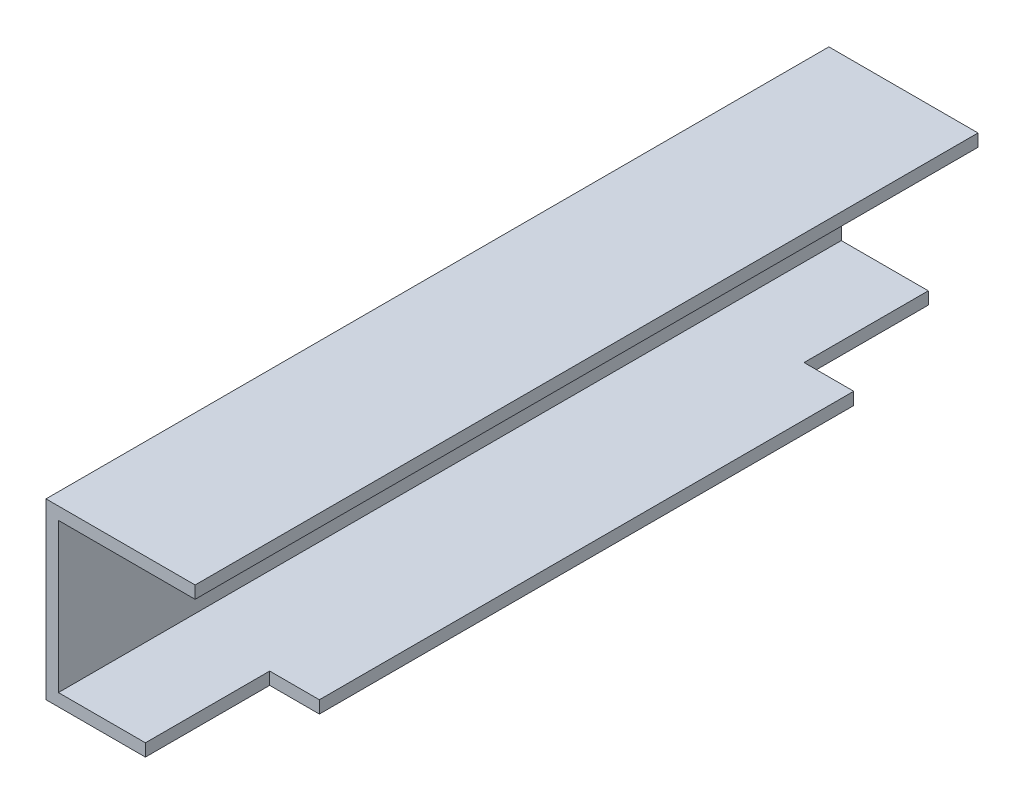
ISO-10303-21;
HEADER;
FILE_DESCRIPTION(('STEP AP214'),'2;1');
FILE_NAME('part.step','',(''),(''),'','','');
FILE_SCHEMA(('AUTOMOTIVE_DESIGN { 1 0 10303 214 1 1 1 1 }'));
ENDSEC;
DATA;
#1=APPLICATION_CONTEXT('core data for automotive mechanical design processes');
#2=APPLICATION_PROTOCOL_DEFINITION('international standard','automotive_design',2000,#1);
#3=PRODUCT_CONTEXT('',#1,'mechanical');
#4=PRODUCT('Part','Part','',(#3));
#5=PRODUCT_RELATED_PRODUCT_CATEGORY('part','',(#4));
#6=PRODUCT_DEFINITION_FORMATION('','',#4);
#7=PRODUCT_DEFINITION_CONTEXT('part definition',#1,'design');
#8=PRODUCT_DEFINITION('design','',#6,#7);
#9=PRODUCT_DEFINITION_SHAPE('','',#8);
#10=(LENGTH_UNIT() NAMED_UNIT(*) SI_UNIT(.MILLI.,.METRE.));
#11=(NAMED_UNIT(*) PLANE_ANGLE_UNIT() SI_UNIT($,.RADIAN.));
#12=(NAMED_UNIT(*) SI_UNIT($,.STERADIAN.) SOLID_ANGLE_UNIT());
#13=UNCERTAINTY_MEASURE_WITH_UNIT(LENGTH_MEASURE(1.E-05),#10,'distance_accuracy_value','');
#14=(GEOMETRIC_REPRESENTATION_CONTEXT(3) GLOBAL_UNCERTAINTY_ASSIGNED_CONTEXT((#13)) GLOBAL_UNIT_ASSIGNED_CONTEXT((#10,
#11,#12)) REPRESENTATION_CONTEXT('',''));
#15=CARTESIAN_POINT('',(0.,0.,0.));
#16=DIRECTION('',(0.,0.,1.));
#17=DIRECTION('',(1.,0.,0.));
#18=AXIS2_PLACEMENT_3D('',#15,#16,#17);
#19=CARTESIAN_POINT('',(0.413333327827212,0.,2.65));
#20=DIRECTION('',(0.,0.,-1.));
#21=DIRECTION('',(-1.,0.,0.));
#22=AXIS2_PLACEMENT_3D('',#19,#20,#21);
#23=PLANE('',#22);
#24=DIRECTION('',(1.,0.,0.));
#25=VECTOR('',#24,1.);
#26=CARTESIAN_POINT('',(0.213333327827213,0.0500000000000002,2.65));
#27=LINE('',#26,#25);
#28=CARTESIAN_POINT('',(0.213333327827213,0.0500000000000002,2.65));
#29=VERTEX_POINT('',#28);
#30=CARTESIAN_POINT('',(0.413333327827212,0.0500000000000003,2.65));
#31=VERTEX_POINT('',#30);
#32=EDGE_CURVE('E11',#29,#31,#27,.T.);
#33=ORIENTED_EDGE('',*,*,#32,.F.);
#34=DIRECTION('',(0.,1.,0.));
#35=VECTOR('',#34,1.);
#36=CARTESIAN_POINT('',(0.213333327827213,0.,2.65));
#37=LINE('',#36,#35);
#38=CARTESIAN_POINT('',(0.213333327827213,0.,2.65));
#39=VERTEX_POINT('',#38);
#40=EDGE_CURVE('E203',#39,#29,#37,.T.);
#41=ORIENTED_EDGE('',*,*,#40,.F.);
#42=DIRECTION('',(-1.,0.,0.));
#43=VECTOR('',#42,1.);
#44=CARTESIAN_POINT('',(0.413333327827212,0.,2.65));
#45=LINE('',#44,#43);
#46=CARTESIAN_POINT('',(0.413333327827212,0.,2.65));
#47=VERTEX_POINT('',#46);
#48=EDGE_CURVE('E195',#47,#39,#45,.T.);
#49=ORIENTED_EDGE('',*,*,#48,.F.);
#50=DIRECTION('',(0.,-1.,0.));
#51=VECTOR('',#50,1.);
#52=CARTESIAN_POINT('',(0.413333327827213,0.0500000000000003,2.65));
#53=LINE('',#52,#51);
#54=EDGE_CURVE('E183',#31,#47,#53,.T.);
#55=ORIENTED_EDGE('',*,*,#54,.F.);
#56=EDGE_LOOP('',(#33,#41,#49,#55));
#57=FACE_BOUND('',#56,.T.);
#58=ADVANCED_FACE('F17',(#57),#23,.F.);
#59=CARTESIAN_POINT('',(0.213333327827213,0.,2.65));
#60=DIRECTION('',(-1.,0.,0.));
#61=DIRECTION('',(0.,0.,1.));
#62=AXIS2_PLACEMENT_3D('',#59,#60,#61);
#63=PLANE('',#62);
#64=DIRECTION('',(0.,0.,-1.));
#65=VECTOR('',#64,1.);
#66=CARTESIAN_POINT('',(0.213333327827213,0.0500000000000002,3.15));
#67=LINE('',#66,#65);
#68=CARTESIAN_POINT('',(0.213333327827212,0.0500000000000002,3.15));
#69=VERTEX_POINT('',#68);
#70=EDGE_CURVE('E24',#69,#29,#67,.T.);
#71=ORIENTED_EDGE('',*,*,#70,.F.);
#72=DIRECTION('',(0.,1.,0.));
#73=VECTOR('',#72,1.);
#74=CARTESIAN_POINT('',(0.213333327827212,0.,3.15));
#75=LINE('',#74,#73);
#76=CARTESIAN_POINT('',(0.213333327827212,0.,3.15));
#77=VERTEX_POINT('',#76);
#78=EDGE_CURVE('E198',#77,#69,#75,.T.);
#79=ORIENTED_EDGE('',*,*,#78,.F.);
#80=DIRECTION('',(0.,0.,1.));
#81=VECTOR('',#80,1.);
#82=CARTESIAN_POINT('',(0.213333327827213,0.,2.65));
#83=LINE('',#82,#81);
#84=EDGE_CURVE('E186',#39,#77,#83,.T.);
#85=ORIENTED_EDGE('',*,*,#84,.F.);
#86=ORIENTED_EDGE('',*,*,#40,.T.);
#87=EDGE_LOOP('',(#71,#79,#85,#86));
#88=FACE_BOUND('',#87,.T.);
#89=ADVANCED_FACE('F209',(#88),#63,.F.);
#90=CARTESIAN_POINT('',(0.213333327827213,0.,0.5));
#91=DIRECTION('',(0.,0.,1.));
#92=DIRECTION('',(1.,0.,0.));
#93=AXIS2_PLACEMENT_3D('',#90,#91,#92);
#94=PLANE('',#93);
#95=DIRECTION('',(-1.,0.,0.));
#96=VECTOR('',#95,1.);
#97=CARTESIAN_POINT('',(0.413333327827213,0.0500000000000003,0.5));
#98=LINE('',#97,#96);
#99=CARTESIAN_POINT('',(0.413333327827213,0.0500000000000003,0.5));
#100=VERTEX_POINT('',#99);
#101=CARTESIAN_POINT('',(0.213333327827213,0.0500000000000002,0.5));
#102=VERTEX_POINT('',#101);
#103=EDGE_CURVE('E200',#100,#102,#98,.T.);
#104=ORIENTED_EDGE('',*,*,#103,.F.);
#105=DIRECTION('',(0.,1.,0.));
#106=VECTOR('',#105,1.);
#107=CARTESIAN_POINT('',(0.413333327827213,0.,0.5));
#108=LINE('',#107,#106);
#109=CARTESIAN_POINT('',(0.413333327827213,0.,0.5));
#110=VERTEX_POINT('',#109);
#111=EDGE_CURVE('E189',#110,#100,#108,.T.);
#112=ORIENTED_EDGE('',*,*,#111,.F.);
#113=DIRECTION('',(1.,0.,0.));
#114=VECTOR('',#113,1.);
#115=CARTESIAN_POINT('',(0.213333327827213,0.,0.5));
#116=LINE('',#115,#114);
#117=CARTESIAN_POINT('',(0.213333327827213,0.,0.5));
#118=VERTEX_POINT('',#117);
#119=EDGE_CURVE('E177',#118,#110,#116,.T.);
#120=ORIENTED_EDGE('',*,*,#119,.F.);
#121=DIRECTION('',(0.,1.,0.));
#122=VECTOR('',#121,1.);
#123=CARTESIAN_POINT('',(0.213333327827213,0.,0.5));
#124=LINE('',#123,#122);
#125=EDGE_CURVE('E180',#118,#102,#124,.T.);
#126=ORIENTED_EDGE('',*,*,#125,.T.);
#127=EDGE_LOOP('',(#104,#112,#120,#126));
#128=FACE_BOUND('',#127,.T.);
#129=ADVANCED_FACE('F217',(#128),#94,.F.);
#130=CARTESIAN_POINT('',(0.213333327827213,0.,0.));
#131=DIRECTION('',(-1.,0.,0.));
#132=DIRECTION('',(0.,0.,1.));
#133=AXIS2_PLACEMENT_3D('',#130,#131,#132);
#134=PLANE('',#133);
#135=DIRECTION('',(0.,0.,-1.));
#136=VECTOR('',#135,1.);
#137=CARTESIAN_POINT('',(0.213333327827213,0.0500000000000002,0.5));
#138=LINE('',#137,#136);
#139=CARTESIAN_POINT('',(0.213333327827213,0.0500000000000002,0.));
#140=VERTEX_POINT('',#139);
#141=EDGE_CURVE('E192',#102,#140,#138,.T.);
#142=ORIENTED_EDGE('',*,*,#141,.F.);
#143=ORIENTED_EDGE('',*,*,#125,.F.);
#144=DIRECTION('',(0.,0.,1.));
#145=VECTOR('',#144,1.);
#146=CARTESIAN_POINT('',(0.213333327827213,0.,0.));
#147=LINE('',#146,#145);
#148=CARTESIAN_POINT('',(0.213333327827213,0.,0.));
#149=VERTEX_POINT('',#148);
#150=EDGE_CURVE('E174',#149,#118,#147,.T.);
#151=ORIENTED_EDGE('',*,*,#150,.F.);
#152=DIRECTION('',(0.,-1.,0.));
#153=VECTOR('',#152,1.);
#154=CARTESIAN_POINT('',(0.213333327827213,0.0500000000000002,0.));
#155=LINE('',#154,#153);
#156=EDGE_CURVE('E164',#140,#149,#155,.T.);
#157=ORIENTED_EDGE('',*,*,#156,.F.);
#158=EDGE_LOOP('',(#142,#143,#151,#157));
#159=FACE_BOUND('',#158,.T.);
#160=ADVANCED_FACE('F220',(#159),#134,.F.);
#161=CARTESIAN_POINT('',(-0.186666672172787,0.,0.));
#162=DIRECTION('',(0.,-1.,0.));
#163=DIRECTION('',(1.,0.,0.));
#164=AXIS2_PLACEMENT_3D('',#161,#162,#163);
#165=PLANE('',#164);
#166=ORIENTED_EDGE('',*,*,#48,.T.);
#167=ORIENTED_EDGE('',*,*,#84,.T.);
#168=DIRECTION('',(1.,0.,0.));
#169=VECTOR('',#168,1.);
#170=CARTESIAN_POINT('',(-0.186666672172787,0.,3.15));
#171=LINE('',#170,#169);
#172=CARTESIAN_POINT('',(-0.186666672172787,0.,3.15));
#173=VERTEX_POINT('',#172);
#174=EDGE_CURVE('E167',#173,#77,#171,.T.);
#175=ORIENTED_EDGE('',*,*,#174,.F.);
#176=DIRECTION('',(0.,0.,1.));
#177=VECTOR('',#176,1.);
#178=CARTESIAN_POINT('',(-0.186666672172787,0.,0.));
#179=LINE('',#178,#177);
#180=CARTESIAN_POINT('',(-0.186666672172787,0.,0.));
#181=VERTEX_POINT('',#180);
#182=EDGE_CURVE('E120',#181,#173,#179,.T.);
#183=ORIENTED_EDGE('',*,*,#182,.F.);
#184=DIRECTION('',(1.,0.,0.));
#185=VECTOR('',#184,1.);
#186=CARTESIAN_POINT('',(-0.186666672172787,0.,0.));
#187=LINE('',#186,#185);
#188=EDGE_CURVE('E148',#181,#149,#187,.T.);
#189=ORIENTED_EDGE('',*,*,#188,.T.);
#190=ORIENTED_EDGE('',*,*,#150,.T.);
#191=ORIENTED_EDGE('',*,*,#119,.T.);
#192=DIRECTION('',(0.,0.,1.));
#193=VECTOR('',#192,1.);
#194=CARTESIAN_POINT('',(0.413333327827213,0.,0.5));
#195=LINE('',#194,#193);
#196=EDGE_CURVE('E169',#110,#47,#195,.T.);
#197=ORIENTED_EDGE('',*,*,#196,.T.);
#198=EDGE_LOOP('',(#166,#167,#175,#183,#189,#190,#191,#197));
#199=FACE_BOUND('',#198,.T.);
#200=ADVANCED_FACE('F211',(#199),#165,.T.);
#201=CARTESIAN_POINT('',(0.413333327827213,0.,0.));
#202=DIRECTION('',(1.,0.,0.));
#203=DIRECTION('',(0.,1.,0.));
#204=AXIS2_PLACEMENT_3D('',#201,#202,#203);
#205=PLANE('',#204);
#206=ORIENTED_EDGE('',*,*,#54,.T.);
#207=ORIENTED_EDGE('',*,*,#196,.F.);
#208=ORIENTED_EDGE('',*,*,#111,.T.);
#209=DIRECTION('',(0.,0.,1.));
#210=VECTOR('',#209,1.);
#211=CARTESIAN_POINT('',(0.413333327827213,0.0500000000000003,0.5));
#212=LINE('',#211,#210);
#213=EDGE_CURVE('E151',#100,#31,#212,.T.);
#214=ORIENTED_EDGE('',*,*,#213,.T.);
#215=EDGE_LOOP('',(#206,#207,#208,#214));
#216=FACE_BOUND('',#215,.T.);
#217=ADVANCED_FACE('F214',(#216),#205,.T.);
#218=CARTESIAN_POINT('',(0.413333327827213,0.65,0.));
#219=DIRECTION('',(1.,0.,0.));
#220=DIRECTION('',(0.,1.,0.));
#221=AXIS2_PLACEMENT_3D('',#218,#219,#220);
#222=PLANE('',#221);
#223=DIRECTION('',(0.,1.,0.));
#224=VECTOR('',#223,1.);
#225=CARTESIAN_POINT('',(0.413333327827213,0.65,0.));
#226=LINE('',#225,#224);
#227=CARTESIAN_POINT('',(0.413333327827213,0.65,0.));
#228=VERTEX_POINT('',#227);
#229=CARTESIAN_POINT('',(0.413333327827213,0.7,0.));
#230=VERTEX_POINT('',#229);
#231=EDGE_CURVE('E172',#228,#230,#226,.T.);
#232=ORIENTED_EDGE('',*,*,#231,.T.);
#233=DIRECTION('',(0.,0.,1.));
#234=VECTOR('',#233,1.);
#235=CARTESIAN_POINT('',(0.413333327827213,0.7,0.));
#236=LINE('',#235,#234);
#237=CARTESIAN_POINT('',(0.413333327827213,0.7,3.15));
#238=VERTEX_POINT('',#237);
#239=EDGE_CURVE('E160',#230,#238,#236,.T.);
#240=ORIENTED_EDGE('',*,*,#239,.T.);
#241=DIRECTION('',(0.,1.,0.));
#242=VECTOR('',#241,1.);
#243=CARTESIAN_POINT('',(0.413333327827213,0.65,3.15));
#244=LINE('',#243,#242);
#245=CARTESIAN_POINT('',(0.413333327827213,0.65,3.15));
#246=VERTEX_POINT('',#245);
#247=EDGE_CURVE('E128',#246,#238,#244,.T.);
#248=ORIENTED_EDGE('',*,*,#247,.F.);
#249=DIRECTION('',(0.,0.,1.));
#250=VECTOR('',#249,1.);
#251=CARTESIAN_POINT('',(0.413333327827213,0.65,0.));
#252=LINE('',#251,#250);
#253=EDGE_CURVE('E155',#228,#246,#252,.T.);
#254=ORIENTED_EDGE('',*,*,#253,.F.);
#255=EDGE_LOOP('',(#232,#240,#248,#254));
#256=FACE_BOUND('',#255,.T.);
#257=ADVANCED_FACE('F235',(#256),#222,.T.);
#258=CARTESIAN_POINT('',(-0.136666672172787,0.65,0.));
#259=DIRECTION('',(0.,-1.,0.));
#260=DIRECTION('',(1.,0.,0.));
#261=AXIS2_PLACEMENT_3D('',#258,#259,#260);
#262=PLANE('',#261);
#263=DIRECTION('',(1.,0.,0.));
#264=VECTOR('',#263,1.);
#265=CARTESIAN_POINT('',(-0.136666672172787,0.65,0.));
#266=LINE('',#265,#264);
#267=CARTESIAN_POINT('',(-0.136666672172787,0.65,0.));
#268=VERTEX_POINT('',#267);
#269=EDGE_CURVE('E162',#268,#228,#266,.T.);
#270=ORIENTED_EDGE('',*,*,#269,.T.);
#271=ORIENTED_EDGE('',*,*,#253,.T.);
#272=DIRECTION('',(1.,0.,0.));
#273=VECTOR('',#272,1.);
#274=CARTESIAN_POINT('',(-0.136666672172787,0.65,3.15));
#275=LINE('',#274,#273);
#276=CARTESIAN_POINT('',(-0.136666672172787,0.65,3.15));
#277=VERTEX_POINT('',#276);
#278=EDGE_CURVE('E144',#277,#246,#275,.T.);
#279=ORIENTED_EDGE('',*,*,#278,.F.);
#280=DIRECTION('',(0.,0.,1.));
#281=VECTOR('',#280,1.);
#282=CARTESIAN_POINT('',(-0.136666672172787,0.65,0.));
#283=LINE('',#282,#281);
#284=EDGE_CURVE('E146',#268,#277,#283,.T.);
#285=ORIENTED_EDGE('',*,*,#284,.F.);
#286=EDGE_LOOP('',(#270,#271,#279,#285));
#287=FACE_BOUND('',#286,.T.);
#288=ADVANCED_FACE('F232',(#287),#262,.T.);
#289=CARTESIAN_POINT('',(-0.136666672172787,0.05,0.));
#290=DIRECTION('',(1.,0.,0.));
#291=DIRECTION('',(0.,1.,0.));
#292=AXIS2_PLACEMENT_3D('',#289,#290,#291);
#293=PLANE('',#292);
#294=DIRECTION('',(0.,1.,0.));
#295=VECTOR('',#294,1.);
#296=CARTESIAN_POINT('',(-0.136666672172787,0.05,0.));
#297=LINE('',#296,#295);
#298=CARTESIAN_POINT('',(-0.136666672172787,0.05,0.));
#299=VERTEX_POINT('',#298);
#300=EDGE_CURVE('E157',#299,#268,#297,.T.);
#301=ORIENTED_EDGE('',*,*,#300,.T.);
#302=ORIENTED_EDGE('',*,*,#284,.T.);
#303=DIRECTION('',(0.,1.,0.));
#304=VECTOR('',#303,1.);
#305=CARTESIAN_POINT('',(-0.136666672172787,0.0499999999999999,3.15));
#306=LINE('',#305,#304);
#307=CARTESIAN_POINT('',(-0.136666672172787,0.0499999999999999,3.15));
#308=VERTEX_POINT('',#307);
#309=EDGE_CURVE('E139',#308,#277,#306,.T.);
#310=ORIENTED_EDGE('',*,*,#309,.F.);
#311=DIRECTION('',(0.,0.,1.));
#312=VECTOR('',#311,1.);
#313=CARTESIAN_POINT('',(-0.136666672172787,0.05,0.));
#314=LINE('',#313,#312);
#315=EDGE_CURVE('E114',#299,#308,#314,.T.);
#316=ORIENTED_EDGE('',*,*,#315,.F.);
#317=EDGE_LOOP('',(#301,#302,#310,#316));
#318=FACE_BOUND('',#317,.T.);
#319=ADVANCED_FACE('F229',(#318),#293,.T.);
#320=CARTESIAN_POINT('',(0.413333327827213,0.0500000000000003,0.));
#321=DIRECTION('',(0.,1.,0.));
#322=DIRECTION('',(-1.,0.,0.));
#323=AXIS2_PLACEMENT_3D('',#320,#321,#322);
#324=PLANE('',#323);
#325=ORIENTED_EDGE('',*,*,#32,.T.);
#326=ORIENTED_EDGE('',*,*,#213,.F.);
#327=ORIENTED_EDGE('',*,*,#103,.T.);
#328=ORIENTED_EDGE('',*,*,#141,.T.);
#329=DIRECTION('',(-1.,0.,0.));
#330=VECTOR('',#329,1.);
#331=CARTESIAN_POINT('',(0.213333327827213,0.0500000000000002,0.));
#332=LINE('',#331,#330);
#333=EDGE_CURVE('E129',#140,#299,#332,.T.);
#334=ORIENTED_EDGE('',*,*,#333,.T.);
#335=ORIENTED_EDGE('',*,*,#315,.T.);
#336=DIRECTION('',(-1.,0.,0.));
#337=VECTOR('',#336,1.);
#338=CARTESIAN_POINT('',(0.213333327827212,0.0500000000000002,3.15));
#339=LINE('',#338,#337);
#340=EDGE_CURVE('E123',#69,#308,#339,.T.);
#341=ORIENTED_EDGE('',*,*,#340,.F.);
#342=ORIENTED_EDGE('',*,*,#70,.T.);
#343=EDGE_LOOP('',(#325,#326,#327,#328,#334,#335,#341,#342));
#344=FACE_BOUND('',#343,.T.);
#345=ADVANCED_FACE('F206',(#344),#324,.T.);
#346=CARTESIAN_POINT('',(-0.186666672172787,0.7,0.));
#347=DIRECTION('',(-1.,0.,0.));
#348=DIRECTION('',(0.,-1.,0.));
#349=AXIS2_PLACEMENT_3D('',#346,#347,#348);
#350=PLANE('',#349);
#351=DIRECTION('',(0.,-1.,0.));
#352=VECTOR('',#351,1.);
#353=CARTESIAN_POINT('',(-0.186666672172787,0.7,0.));
#354=LINE('',#353,#352);
#355=CARTESIAN_POINT('',(-0.186666672172787,0.7,0.));
#356=VERTEX_POINT('',#355);
#357=EDGE_CURVE('E142',#356,#181,#354,.T.);
#358=ORIENTED_EDGE('',*,*,#357,.T.);
#359=ORIENTED_EDGE('',*,*,#182,.T.);
#360=DIRECTION('',(0.,-1.,0.));
#361=VECTOR('',#360,1.);
#362=CARTESIAN_POINT('',(-0.186666672172787,0.7,3.15));
#363=LINE('',#362,#361);
#364=CARTESIAN_POINT('',(-0.186666672172787,0.7,3.15));
#365=VERTEX_POINT('',#364);
#366=EDGE_CURVE('E115',#365,#173,#363,.T.);
#367=ORIENTED_EDGE('',*,*,#366,.F.);
#368=DIRECTION('',(0.,0.,1.));
#369=VECTOR('',#368,1.);
#370=CARTESIAN_POINT('',(-0.186666672172787,0.7,0.));
#371=LINE('',#370,#369);
#372=EDGE_CURVE('E102',#356,#365,#371,.T.);
#373=ORIENTED_EDGE('',*,*,#372,.F.);
#374=EDGE_LOOP('',(#358,#359,#367,#373));
#375=FACE_BOUND('',#374,.T.);
#376=ADVANCED_FACE('F119',(#375),#350,.T.);
#377=CARTESIAN_POINT('',(0.413333327827213,0.7,0.));
#378=DIRECTION('',(0.,1.,0.));
#379=DIRECTION('',(-1.,0.,0.));
#380=AXIS2_PLACEMENT_3D('',#377,#378,#379);
#381=PLANE('',#380);
#382=DIRECTION('',(-1.,0.,0.));
#383=VECTOR('',#382,1.);
#384=CARTESIAN_POINT('',(0.413333327827213,0.7,0.));
#385=LINE('',#384,#383);
#386=EDGE_CURVE('E110',#230,#356,#385,.T.);
#387=ORIENTED_EDGE('',*,*,#386,.T.);
#388=ORIENTED_EDGE('',*,*,#372,.T.);
#389=DIRECTION('',(-1.,0.,0.));
#390=VECTOR('',#389,1.);
#391=CARTESIAN_POINT('',(0.413333327827213,0.7,3.15));
#392=LINE('',#391,#390);
#393=EDGE_CURVE('E107',#238,#365,#392,.T.);
#394=ORIENTED_EDGE('',*,*,#393,.F.);
#395=ORIENTED_EDGE('',*,*,#239,.F.);
#396=EDGE_LOOP('',(#387,#388,#394,#395));
#397=FACE_BOUND('',#396,.T.);
#398=ADVANCED_FACE('F104',(#397),#381,.T.);
#399=CARTESIAN_POINT('',(0.0315765710704564,0.35,3.15));
#400=DIRECTION('',(0.,0.,1.));
#401=DIRECTION('',(1.,0.,0.));
#402=AXIS2_PLACEMENT_3D('',#399,#400,#401);
#403=PLANE('',#402);
#404=ORIENTED_EDGE('',*,*,#78,.T.);
#405=ORIENTED_EDGE('',*,*,#340,.T.);
#406=ORIENTED_EDGE('',*,*,#309,.T.);
#407=ORIENTED_EDGE('',*,*,#278,.T.);
#408=ORIENTED_EDGE('',*,*,#247,.T.);
#409=ORIENTED_EDGE('',*,*,#393,.T.);
#410=ORIENTED_EDGE('',*,*,#366,.T.);
#411=ORIENTED_EDGE('',*,*,#174,.T.);
#412=EDGE_LOOP('',(#404,#405,#406,#407,#408,#409,#410,#411));
#413=FACE_BOUND('',#412,.T.);
#414=ADVANCED_FACE('F125',(#413),#403,.T.);
#415=CARTESIAN_POINT('',(0.0315765710704565,0.35,0.));
#416=DIRECTION('',(0.,0.,1.));
#417=DIRECTION('',(1.,0.,0.));
#418=AXIS2_PLACEMENT_3D('',#415,#416,#417);
#419=PLANE('',#418);
#420=ORIENTED_EDGE('',*,*,#156,.T.);
#421=ORIENTED_EDGE('',*,*,#188,.F.);
#422=ORIENTED_EDGE('',*,*,#357,.F.);
#423=ORIENTED_EDGE('',*,*,#386,.F.);
#424=ORIENTED_EDGE('',*,*,#231,.F.);
#425=ORIENTED_EDGE('',*,*,#269,.F.);
#426=ORIENTED_EDGE('',*,*,#300,.F.);
#427=ORIENTED_EDGE('',*,*,#333,.F.);
#428=EDGE_LOOP('',(#420,#421,#422,#423,#424,#425,#426,#427));
#429=FACE_BOUND('',#428,.T.);
#430=ADVANCED_FACE('F223',(#429),#419,.F.);
#431=CLOSED_SHELL('',(#58,#89,#129,#160,#200,#217,#257,#288,#319,#345,#376,#398,#414,#430));
#432=MANIFOLD_SOLID_BREP('B1',#431);
#433=ADVANCED_BREP_SHAPE_REPRESENTATION('',(#18,#432),#14);
#434=SHAPE_DEFINITION_REPRESENTATION(#9,#433);
ENDSEC;
END-ISO-10303-21;
